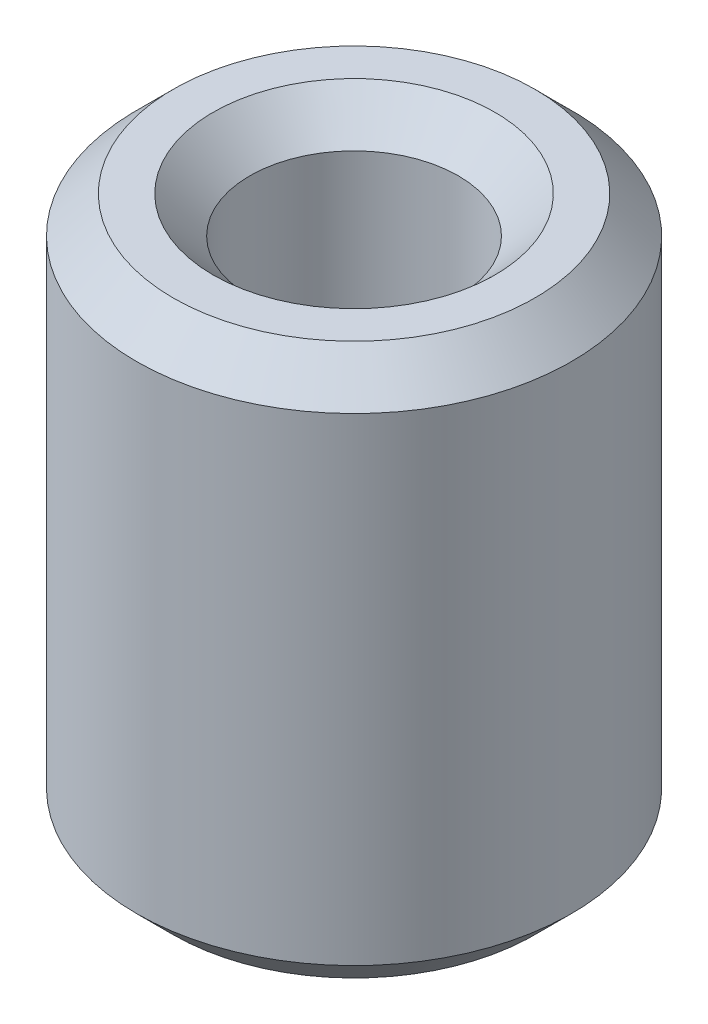
ISO-10303-21;
HEADER;
FILE_DESCRIPTION(('STEP AP214'),'2;1');
FILE_NAME('part.step','',(''),(''),'','','');
FILE_SCHEMA(('AUTOMOTIVE_DESIGN { 1 0 10303 214 1 1 1 1 }'));
ENDSEC;
DATA;
#1=APPLICATION_CONTEXT('core data for automotive mechanical design processes');
#2=APPLICATION_PROTOCOL_DEFINITION('international standard','automotive_design',2000,#1);
#3=PRODUCT_CONTEXT('',#1,'mechanical');
#4=PRODUCT('Part','Part','',(#3));
#5=PRODUCT_RELATED_PRODUCT_CATEGORY('part','',(#4));
#6=PRODUCT_DEFINITION_FORMATION('','',#4);
#7=PRODUCT_DEFINITION_CONTEXT('part definition',#1,'design');
#8=PRODUCT_DEFINITION('design','',#6,#7);
#9=PRODUCT_DEFINITION_SHAPE('','',#8);
#10=(LENGTH_UNIT() NAMED_UNIT(*) SI_UNIT(.MILLI.,.METRE.));
#11=(NAMED_UNIT(*) PLANE_ANGLE_UNIT() SI_UNIT($,.RADIAN.));
#12=(NAMED_UNIT(*) SI_UNIT($,.STERADIAN.) SOLID_ANGLE_UNIT());
#13=UNCERTAINTY_MEASURE_WITH_UNIT(LENGTH_MEASURE(1.E-05),#10,'distance_accuracy_value','');
#14=(GEOMETRIC_REPRESENTATION_CONTEXT(3) GLOBAL_UNCERTAINTY_ASSIGNED_CONTEXT((#13)) GLOBAL_UNIT_ASSIGNED_CONTEXT((#10,
#11,#12)) REPRESENTATION_CONTEXT('',''));
#15=CARTESIAN_POINT('',(0.,0.,0.));
#16=DIRECTION('',(0.,0.,1.));
#17=DIRECTION('',(1.,0.,0.));
#18=AXIS2_PLACEMENT_3D('',#15,#16,#17);
#19=CARTESIAN_POINT('',(0.,19.0141764204809,0.));
#20=DIRECTION('',(0.,-1.,0.));
#21=DIRECTION('',(0.,0.,-1.));
#22=AXIS2_PLACEMENT_3D('',#19,#20,#21);
#23=CYLINDRICAL_SURFACE('',#22,7.5);
#24=CARTESIAN_POINT('',(0.,1.26470128242839,0.));
#25=DIRECTION('',(0.,1.,0.));
#26=DIRECTION('',(0.,0.,1.));
#27=AXIS2_PLACEMENT_3D('',#24,#25,#26);
#28=CIRCLE('',#27,7.5);
#29=CARTESIAN_POINT('',(0.,1.26470128242839,7.5));
#30=VERTEX_POINT('',#29);
#31=EDGE_CURVE('E10',#30,#30,#28,.T.);
#32=ORIENTED_EDGE('',*,*,#31,.T.);
#33=EDGE_LOOP('',(#32));
#34=FACE_BOUND('',#33,.T.);
#35=CARTESIAN_POINT('',(0.,17.7494751380525,0.));
#36=DIRECTION('',(0.,1.,0.));
#37=DIRECTION('',(0.,0.,1.));
#38=AXIS2_PLACEMENT_3D('',#35,#36,#37);
#39=CIRCLE('',#38,7.5);
#40=CARTESIAN_POINT('',(0.,17.7494751380525,7.5));
#41=VERTEX_POINT('',#40);
#42=EDGE_CURVE('E50',#41,#41,#39,.F.);
#43=ORIENTED_EDGE('',*,*,#42,.T.);
#44=EDGE_LOOP('',(#43));
#45=FACE_BOUND('',#44,.T.);
#46=ADVANCED_FACE('F39',(#34,#45),#23,.T.);
#47=CARTESIAN_POINT('',(0.,19.0141764204809,0.));
#48=DIRECTION('',(0.,1.,0.));
#49=DIRECTION('',(0.,0.,1.));
#50=AXIS2_PLACEMENT_3D('',#47,#48,#49);
#51=PLANE('',#50);
#52=CARTESIAN_POINT('',(0.,19.0141764204809,0.));
#53=DIRECTION('',(0.,1.,0.));
#54=DIRECTION('',(0.,0.,1.));
#55=AXIS2_PLACEMENT_3D('',#52,#53,#54);
#56=CIRCLE('',#55,4.85984420573265);
#57=CARTESIAN_POINT('',(0.,19.0141764204809,4.85984420573265));
#58=VERTEX_POINT('',#57);
#59=EDGE_CURVE('E58',#58,#58,#56,.F.);
#60=ORIENTED_EDGE('',*,*,#59,.T.);
#61=EDGE_LOOP('',(#60));
#62=FACE_BOUND('',#61,.T.);
#63=CARTESIAN_POINT('',(0.,19.0141764204809,0.));
#64=DIRECTION('',(0.,1.,0.));
#65=DIRECTION('',(0.,0.,1.));
#66=AXIS2_PLACEMENT_3D('',#63,#64,#65);
#67=CIRCLE('',#66,6.23529871757161);
#68=CARTESIAN_POINT('',(0.,19.0141764204809,6.23529871757161));
#69=VERTEX_POINT('',#68);
#70=EDGE_CURVE('E61',#69,#69,#67,.T.);
#71=ORIENTED_EDGE('',*,*,#70,.T.);
#72=EDGE_LOOP('',(#71));
#73=FACE_BOUND('',#72,.T.);
#74=ADVANCED_FACE('F88',(#62,#73),#51,.T.);
#75=CARTESIAN_POINT('',(0.,0.,0.));
#76=DIRECTION('',(0.,1.,0.));
#77=DIRECTION('',(0.,0.,1.));
#78=AXIS2_PLACEMENT_3D('',#75,#76,#77);
#79=PLANE('',#78);
#80=CARTESIAN_POINT('',(0.,0.,0.));
#81=DIRECTION('',(0.,1.,0.));
#82=DIRECTION('',(0.,0.,1.));
#83=AXIS2_PLACEMENT_3D('',#80,#81,#82);
#84=CIRCLE('',#83,4.85984420573265);
#85=CARTESIAN_POINT('',(0.,0.,4.85984420573265));
#86=VERTEX_POINT('',#85);
#87=EDGE_CURVE('E51',#86,#86,#84,.T.);
#88=ORIENTED_EDGE('',*,*,#87,.T.);
#89=EDGE_LOOP('',(#88));
#90=FACE_BOUND('',#89,.T.);
#91=CARTESIAN_POINT('',(0.,0.,0.));
#92=DIRECTION('',(0.,1.,0.));
#93=DIRECTION('',(0.,0.,1.));
#94=AXIS2_PLACEMENT_3D('',#91,#92,#93);
#95=CIRCLE('',#94,6.2352987175716);
#96=CARTESIAN_POINT('',(0.,0.,6.2352987175716));
#97=VERTEX_POINT('',#96);
#98=EDGE_CURVE('E54',#97,#97,#95,.F.);
#99=ORIENTED_EDGE('',*,*,#98,.T.);
#100=EDGE_LOOP('',(#99));
#101=FACE_BOUND('',#100,.T.);
#102=ADVANCED_FACE('F83',(#90,#101),#79,.F.);
#103=CARTESIAN_POINT('',(0.,19.0141764204809,0.));
#104=DIRECTION('',(0.,-1.,0.));
#105=DIRECTION('',(0.,0.,-1.));
#106=AXIS2_PLACEMENT_3D('',#103,#104,#105);
#107=CYLINDRICAL_SURFACE('',#106,3.59514292330426);
#108=CARTESIAN_POINT('',(0.,17.7494751380525,0.));
#109=DIRECTION('',(0.,1.,0.));
#110=DIRECTION('',(0.,0.,1.));
#111=AXIS2_PLACEMENT_3D('',#108,#109,#110);
#112=CIRCLE('',#111,3.59514292330426);
#113=CARTESIAN_POINT('',(0.,17.7494751380525,3.59514292330426));
#114=VERTEX_POINT('',#113);
#115=EDGE_CURVE('E67',#114,#114,#112,.T.);
#116=ORIENTED_EDGE('',*,*,#115,.T.);
#117=EDGE_LOOP('',(#116));
#118=FACE_BOUND('',#117,.T.);
#119=CARTESIAN_POINT('',(0.,1.2647012824284,0.));
#120=DIRECTION('',(0.,1.,0.));
#121=DIRECTION('',(0.,0.,1.));
#122=AXIS2_PLACEMENT_3D('',#119,#120,#121);
#123=CIRCLE('',#122,3.59514292330426);
#124=CARTESIAN_POINT('',(0.,1.2647012824284,3.59514292330426));
#125=VERTEX_POINT('',#124);
#126=EDGE_CURVE('E69',#125,#125,#123,.F.);
#127=ORIENTED_EDGE('',*,*,#126,.T.);
#128=EDGE_LOOP('',(#127));
#129=FACE_BOUND('',#128,.T.);
#130=ADVANCED_FACE('F71',(#118,#129),#107,.F.);
#131=CARTESIAN_POINT('',(0.,17.7494751380525,0.));
#132=DIRECTION('',(0.,1.,0.));
#133=DIRECTION('',(0.,0.,1.));
#134=AXIS2_PLACEMENT_3D('',#131,#132,#133);
#135=CONICAL_SURFACE('',#134,3.59514292330426,0.785398163397452);
#136=ORIENTED_EDGE('',*,*,#59,.F.);
#137=EDGE_LOOP('',(#136));
#138=FACE_BOUND('',#137,.T.);
#139=ORIENTED_EDGE('',*,*,#115,.F.);
#140=EDGE_LOOP('',(#139));
#141=FACE_BOUND('',#140,.T.);
#142=ADVANCED_FACE('F77',(#138,#141),#135,.F.);
#143=CARTESIAN_POINT('',(0.,0.,0.));
#144=DIRECTION('',(0.,-1.,0.));
#145=DIRECTION('',(0.,0.,-1.));
#146=AXIS2_PLACEMENT_3D('',#143,#144,#145);
#147=CONICAL_SURFACE('',#146,4.85984420573265,0.785398163397445);
#148=ORIENTED_EDGE('',*,*,#126,.F.);
#149=EDGE_LOOP('',(#148));
#150=FACE_BOUND('',#149,.T.);
#151=ORIENTED_EDGE('',*,*,#87,.F.);
#152=EDGE_LOOP('',(#151));
#153=FACE_BOUND('',#152,.T.);
#154=ADVANCED_FACE('F73',(#150,#153),#147,.F.);
#155=CARTESIAN_POINT('',(0.,1.26470128242839,0.));
#156=DIRECTION('',(0.,1.,0.));
#157=DIRECTION('',(0.,0.,1.));
#158=AXIS2_PLACEMENT_3D('',#155,#156,#157);
#159=CONICAL_SURFACE('',#158,7.5,0.785398163397453);
#160=ORIENTED_EDGE('',*,*,#98,.F.);
#161=EDGE_LOOP('',(#160));
#162=FACE_BOUND('',#161,.T.);
#163=ORIENTED_EDGE('',*,*,#31,.F.);
#164=EDGE_LOOP('',(#163));
#165=FACE_BOUND('',#164,.T.);
#166=ADVANCED_FACE('F76',(#162,#165),#159,.T.);
#167=CARTESIAN_POINT('',(0.,19.0141764204809,0.));
#168=DIRECTION('',(0.,-1.,0.));
#169=DIRECTION('',(0.,0.,-1.));
#170=AXIS2_PLACEMENT_3D('',#167,#168,#169);
#171=CONICAL_SURFACE('',#170,6.23529871757161,0.785398163397446);
#172=ORIENTED_EDGE('',*,*,#42,.F.);
#173=EDGE_LOOP('',(#172));
#174=FACE_BOUND('',#173,.T.);
#175=ORIENTED_EDGE('',*,*,#70,.F.);
#176=EDGE_LOOP('',(#175));
#177=FACE_BOUND('',#176,.T.);
#178=ADVANCED_FACE('F45',(#174,#177),#171,.T.);
#179=CLOSED_SHELL('',(#46,#74,#102,#130,#142,#154,#166,#178));
#180=MANIFOLD_SOLID_BREP('B2',#179);
#181=ADVANCED_BREP_SHAPE_REPRESENTATION('',(#18,#180),#14);
#182=SHAPE_DEFINITION_REPRESENTATION(#9,#181);
ENDSEC;
END-ISO-10303-21;
